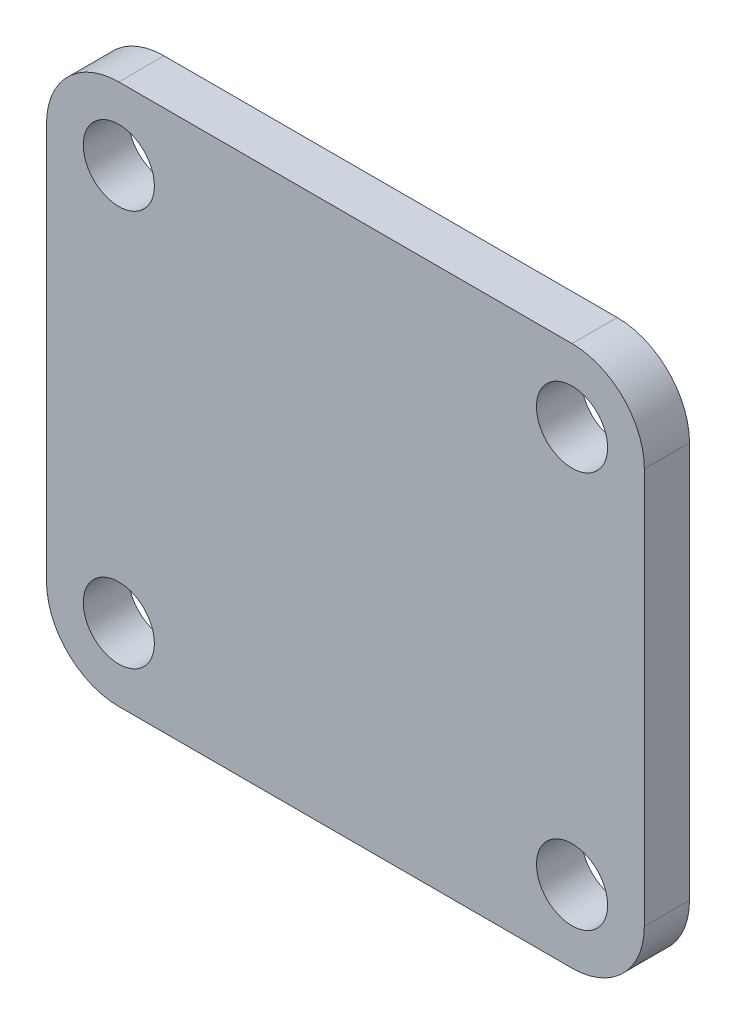
ISO-10303-21;
HEADER;
FILE_DESCRIPTION(('STEP AP214'),'2;1');
FILE_NAME('part.step','',(''),(''),'','','');
FILE_SCHEMA(('AUTOMOTIVE_DESIGN { 1 0 10303 214 1 1 1 1 }'));
ENDSEC;
DATA;
#1=APPLICATION_CONTEXT('core data for automotive mechanical design processes');
#2=APPLICATION_PROTOCOL_DEFINITION('international standard','automotive_design',2000,#1);
#3=PRODUCT_CONTEXT('',#1,'mechanical');
#4=PRODUCT('Part','Part','',(#3));
#5=PRODUCT_RELATED_PRODUCT_CATEGORY('part','',(#4));
#6=PRODUCT_DEFINITION_FORMATION('','',#4);
#7=PRODUCT_DEFINITION_CONTEXT('part definition',#1,'design');
#8=PRODUCT_DEFINITION('design','',#6,#7);
#9=PRODUCT_DEFINITION_SHAPE('','',#8);
#10=(LENGTH_UNIT() NAMED_UNIT(*) SI_UNIT(.MILLI.,.METRE.));
#11=(NAMED_UNIT(*) PLANE_ANGLE_UNIT() SI_UNIT($,.RADIAN.));
#12=(NAMED_UNIT(*) SI_UNIT($,.STERADIAN.) SOLID_ANGLE_UNIT());
#13=UNCERTAINTY_MEASURE_WITH_UNIT(LENGTH_MEASURE(1.E-05),#10,'distance_accuracy_value','');
#14=(GEOMETRIC_REPRESENTATION_CONTEXT(3) GLOBAL_UNCERTAINTY_ASSIGNED_CONTEXT((#13)) GLOBAL_UNIT_ASSIGNED_CONTEXT((#10,
#11,#12)) REPRESENTATION_CONTEXT('',''));
#15=CARTESIAN_POINT('',(0.,0.,0.));
#16=DIRECTION('',(0.,0.,1.));
#17=DIRECTION('',(1.,0.,0.));
#18=AXIS2_PLACEMENT_3D('',#15,#16,#17);
#19=CARTESIAN_POINT('',(-7.96,-6.96,1.5875));
#20=DIRECTION('',(0.,0.,-1.));
#21=DIRECTION('',(-1.,0.,0.));
#22=AXIS2_PLACEMENT_3D('',#19,#20,#21);
#23=CYLINDRICAL_SURFACE('',#22,2.54);
#24=CARTESIAN_POINT('',(-7.96,-6.96,0.));
#25=DIRECTION('',(0.,0.,1.));
#26=DIRECTION('',(-1.,0.,0.));
#27=AXIS2_PLACEMENT_3D('',#24,#25,#26);
#28=CIRCLE('',#27,2.54);
#29=CARTESIAN_POINT('',(-10.5,-6.96,0.));
#30=VERTEX_POINT('',#29);
#31=CARTESIAN_POINT('',(-7.96,-9.5,0.));
#32=VERTEX_POINT('',#31);
#33=EDGE_CURVE('E142',#30,#32,#28,.T.);
#34=ORIENTED_EDGE('',*,*,#33,.T.);
#35=DIRECTION('',(0.,0.,-1.));
#36=VECTOR('',#35,1.);
#37=CARTESIAN_POINT('',(-7.96,-9.5,1.5875));
#38=LINE('',#37,#36);
#39=CARTESIAN_POINT('',(-7.96,-9.5,1.5875));
#40=VERTEX_POINT('',#39);
#41=EDGE_CURVE('E11',#40,#32,#38,.T.);
#42=ORIENTED_EDGE('',*,*,#41,.F.);
#43=CARTESIAN_POINT('',(-7.96,-6.96,1.5875));
#44=DIRECTION('',(0.,0.,1.));
#45=DIRECTION('',(-1.,0.,0.));
#46=AXIS2_PLACEMENT_3D('',#43,#44,#45);
#47=CIRCLE('',#46,2.54);
#48=CARTESIAN_POINT('',(-10.5,-6.96,1.5875));
#49=VERTEX_POINT('',#48);
#50=EDGE_CURVE('E165',#49,#40,#47,.T.);
#51=ORIENTED_EDGE('',*,*,#50,.F.);
#52=DIRECTION('',(0.,0.,-1.));
#53=VECTOR('',#52,1.);
#54=CARTESIAN_POINT('',(-10.5,-6.96,1.5875));
#55=LINE('',#54,#53);
#56=EDGE_CURVE('E138',#49,#30,#55,.T.);
#57=ORIENTED_EDGE('',*,*,#56,.T.);
#58=EDGE_LOOP('',(#34,#42,#51,#57));
#59=FACE_BOUND('',#58,.T.);
#60=ADVANCED_FACE('F39',(#59),#23,.T.);
#61=CARTESIAN_POINT('',(7.96,-9.5,1.5875));
#62=DIRECTION('',(0.,1.,0.));
#63=DIRECTION('',(0.,0.,1.));
#64=AXIS2_PLACEMENT_3D('',#61,#62,#63);
#65=PLANE('',#64);
#66=DIRECTION('',(1.,0.,0.));
#67=VECTOR('',#66,1.);
#68=CARTESIAN_POINT('',(7.96,-9.5,0.));
#69=LINE('',#68,#67);
#70=CARTESIAN_POINT('',(7.96,-9.5,0.));
#71=VERTEX_POINT('',#70);
#72=EDGE_CURVE('E146',#32,#71,#69,.T.);
#73=ORIENTED_EDGE('',*,*,#72,.T.);
#74=DIRECTION('',(0.,0.,-1.));
#75=VECTOR('',#74,1.);
#76=CARTESIAN_POINT('',(7.96,-9.5,1.5875));
#77=LINE('',#76,#75);
#78=CARTESIAN_POINT('',(7.96,-9.5,1.5875));
#79=VERTEX_POINT('',#78);
#80=EDGE_CURVE('E48',#79,#71,#77,.T.);
#81=ORIENTED_EDGE('',*,*,#80,.F.);
#82=DIRECTION('',(1.,0.,0.));
#83=VECTOR('',#82,1.);
#84=CARTESIAN_POINT('',(7.96,-9.5,1.5875));
#85=LINE('',#84,#83);
#86=EDGE_CURVE('E99',#40,#79,#85,.T.);
#87=ORIENTED_EDGE('',*,*,#86,.F.);
#88=ORIENTED_EDGE('',*,*,#41,.T.);
#89=EDGE_LOOP('',(#73,#81,#87,#88));
#90=FACE_BOUND('',#89,.T.);
#91=ADVANCED_FACE('F268',(#90),#65,.F.);
#92=CARTESIAN_POINT('',(7.96,-6.96,1.5875));
#93=DIRECTION('',(0.,0.,-1.));
#94=DIRECTION('',(-1.,0.,0.));
#95=AXIS2_PLACEMENT_3D('',#92,#93,#94);
#96=CYLINDRICAL_SURFACE('',#95,2.54);
#97=CARTESIAN_POINT('',(7.96,-6.96,0.));
#98=DIRECTION('',(0.,0.,1.));
#99=DIRECTION('',(1.,0.,0.));
#100=AXIS2_PLACEMENT_3D('',#97,#98,#99);
#101=CIRCLE('',#100,2.54);
#102=CARTESIAN_POINT('',(10.5,-6.96,0.));
#103=VERTEX_POINT('',#102);
#104=EDGE_CURVE('E150',#71,#103,#101,.T.);
#105=ORIENTED_EDGE('',*,*,#104,.T.);
#106=DIRECTION('',(0.,0.,-1.));
#107=VECTOR('',#106,1.);
#108=CARTESIAN_POINT('',(10.5,-6.96,1.5875));
#109=LINE('',#108,#107);
#110=CARTESIAN_POINT('',(10.5,-6.96,1.5875));
#111=VERTEX_POINT('',#110);
#112=EDGE_CURVE('E176',#111,#103,#109,.T.);
#113=ORIENTED_EDGE('',*,*,#112,.F.);
#114=CARTESIAN_POINT('',(7.96,-6.96,1.5875));
#115=DIRECTION('',(0.,0.,1.));
#116=DIRECTION('',(1.,0.,0.));
#117=AXIS2_PLACEMENT_3D('',#114,#115,#116);
#118=CIRCLE('',#117,2.54);
#119=EDGE_CURVE('E187',#79,#111,#118,.T.);
#120=ORIENTED_EDGE('',*,*,#119,.F.);
#121=ORIENTED_EDGE('',*,*,#80,.T.);
#122=EDGE_LOOP('',(#105,#113,#120,#121));
#123=FACE_BOUND('',#122,.T.);
#124=ADVANCED_FACE('F185',(#123),#96,.T.);
#125=CARTESIAN_POINT('',(10.5,-6.96,1.5875));
#126=DIRECTION('',(-1.,0.,0.));
#127=DIRECTION('',(0.,0.,1.));
#128=AXIS2_PLACEMENT_3D('',#125,#126,#127);
#129=PLANE('',#128);
#130=DIRECTION('',(0.,1.,0.));
#131=VECTOR('',#130,1.);
#132=CARTESIAN_POINT('',(10.5,-6.96,0.));
#133=LINE('',#132,#131);
#134=CARTESIAN_POINT('',(10.5,6.96,0.));
#135=VERTEX_POINT('',#134);
#136=EDGE_CURVE('E153',#103,#135,#133,.T.);
#137=ORIENTED_EDGE('',*,*,#136,.T.);
#138=DIRECTION('',(0.,0.,-1.));
#139=VECTOR('',#138,1.);
#140=CARTESIAN_POINT('',(10.5,6.96,1.5875));
#141=LINE('',#140,#139);
#142=CARTESIAN_POINT('',(10.5,6.96,1.5875));
#143=VERTEX_POINT('',#142);
#144=EDGE_CURVE('E172',#143,#135,#141,.T.);
#145=ORIENTED_EDGE('',*,*,#144,.F.);
#146=DIRECTION('',(0.,1.,0.));
#147=VECTOR('',#146,1.);
#148=CARTESIAN_POINT('',(10.5,-6.96,1.5875));
#149=LINE('',#148,#147);
#150=EDGE_CURVE('E200',#111,#143,#149,.T.);
#151=ORIENTED_EDGE('',*,*,#150,.F.);
#152=ORIENTED_EDGE('',*,*,#112,.T.);
#153=EDGE_LOOP('',(#137,#145,#151,#152));
#154=FACE_BOUND('',#153,.T.);
#155=ADVANCED_FACE('F195',(#154),#129,.F.);
#156=CARTESIAN_POINT('',(7.96,6.96,1.5875));
#157=DIRECTION('',(0.,0.,-1.));
#158=DIRECTION('',(-1.,0.,0.));
#159=AXIS2_PLACEMENT_3D('',#156,#157,#158);
#160=CYLINDRICAL_SURFACE('',#159,2.54);
#161=CARTESIAN_POINT('',(7.96,6.96,0.));
#162=DIRECTION('',(0.,0.,1.));
#163=DIRECTION('',(1.,0.,0.));
#164=AXIS2_PLACEMENT_3D('',#161,#162,#163);
#165=CIRCLE('',#164,2.54);
#166=CARTESIAN_POINT('',(7.96,9.5,0.));
#167=VERTEX_POINT('',#166);
#168=EDGE_CURVE('E156',#135,#167,#165,.T.);
#169=ORIENTED_EDGE('',*,*,#168,.T.);
#170=DIRECTION('',(0.,0.,-1.));
#171=VECTOR('',#170,1.);
#172=CARTESIAN_POINT('',(7.96,9.5,1.5875));
#173=LINE('',#172,#171);
#174=CARTESIAN_POINT('',(7.96,9.5,1.5875));
#175=VERTEX_POINT('',#174);
#176=EDGE_CURVE('E129',#175,#167,#173,.T.);
#177=ORIENTED_EDGE('',*,*,#176,.F.);
#178=CARTESIAN_POINT('',(7.96,6.96,1.5875));
#179=DIRECTION('',(0.,0.,1.));
#180=DIRECTION('',(1.,0.,0.));
#181=AXIS2_PLACEMENT_3D('',#178,#179,#180);
#182=CIRCLE('',#181,2.54);
#183=EDGE_CURVE('E118',#143,#175,#182,.T.);
#184=ORIENTED_EDGE('',*,*,#183,.F.);
#185=ORIENTED_EDGE('',*,*,#144,.T.);
#186=EDGE_LOOP('',(#169,#177,#184,#185));
#187=FACE_BOUND('',#186,.T.);
#188=ADVANCED_FACE('F198',(#187),#160,.T.);
#189=CARTESIAN_POINT('',(7.96,9.5,1.5875));
#190=DIRECTION('',(0.,-1.,0.));
#191=DIRECTION('',(0.,0.,-1.));
#192=AXIS2_PLACEMENT_3D('',#189,#190,#191);
#193=PLANE('',#192);
#194=DIRECTION('',(-1.,0.,0.));
#195=VECTOR('',#194,1.);
#196=CARTESIAN_POINT('',(7.96,9.5,0.));
#197=LINE('',#196,#195);
#198=CARTESIAN_POINT('',(-7.96,9.5,0.));
#199=VERTEX_POINT('',#198);
#200=EDGE_CURVE('E127',#167,#199,#197,.T.);
#201=ORIENTED_EDGE('',*,*,#200,.T.);
#202=DIRECTION('',(0.,0.,-1.));
#203=VECTOR('',#202,1.);
#204=CARTESIAN_POINT('',(-7.96,9.5,1.5875));
#205=LINE('',#204,#203);
#206=CARTESIAN_POINT('',(-7.96,9.5,1.5875));
#207=VERTEX_POINT('',#206);
#208=EDGE_CURVE('E124',#207,#199,#205,.T.);
#209=ORIENTED_EDGE('',*,*,#208,.F.);
#210=DIRECTION('',(-1.,0.,0.));
#211=VECTOR('',#210,1.);
#212=CARTESIAN_POINT('',(7.96,9.5,1.5875));
#213=LINE('',#212,#211);
#214=EDGE_CURVE('E112',#175,#207,#213,.T.);
#215=ORIENTED_EDGE('',*,*,#214,.F.);
#216=ORIENTED_EDGE('',*,*,#176,.T.);
#217=EDGE_LOOP('',(#201,#209,#215,#216));
#218=FACE_BOUND('',#217,.T.);
#219=ADVANCED_FACE('F125',(#218),#193,.F.);
#220=CARTESIAN_POINT('',(-7.96,6.96,1.5875));
#221=DIRECTION('',(0.,0.,-1.));
#222=DIRECTION('',(-1.,0.,0.));
#223=AXIS2_PLACEMENT_3D('',#220,#221,#222);
#224=CYLINDRICAL_SURFACE('',#223,2.54);
#225=CARTESIAN_POINT('',(-7.96,6.96,0.));
#226=DIRECTION('',(0.,0.,1.));
#227=DIRECTION('',(1.,0.,0.));
#228=AXIS2_PLACEMENT_3D('',#225,#226,#227);
#229=CIRCLE('',#228,2.54);
#230=CARTESIAN_POINT('',(-10.5,6.96,0.));
#231=VERTEX_POINT('',#230);
#232=EDGE_CURVE('E85',#199,#231,#229,.T.);
#233=ORIENTED_EDGE('',*,*,#232,.T.);
#234=DIRECTION('',(0.,0.,-1.));
#235=VECTOR('',#234,1.);
#236=CARTESIAN_POINT('',(-10.5,6.96,1.5875));
#237=LINE('',#236,#235);
#238=CARTESIAN_POINT('',(-10.5,6.96,1.5875));
#239=VERTEX_POINT('',#238);
#240=EDGE_CURVE('E130',#239,#231,#237,.T.);
#241=ORIENTED_EDGE('',*,*,#240,.F.);
#242=CARTESIAN_POINT('',(-7.96,6.96,1.5875));
#243=DIRECTION('',(0.,0.,1.));
#244=DIRECTION('',(1.,0.,0.));
#245=AXIS2_PLACEMENT_3D('',#242,#243,#244);
#246=CIRCLE('',#245,2.54);
#247=EDGE_CURVE('E116',#207,#239,#246,.T.);
#248=ORIENTED_EDGE('',*,*,#247,.F.);
#249=ORIENTED_EDGE('',*,*,#208,.T.);
#250=EDGE_LOOP('',(#233,#241,#248,#249));
#251=FACE_BOUND('',#250,.T.);
#252=ADVANCED_FACE('F132',(#251),#224,.T.);
#253=CARTESIAN_POINT('',(-10.5,-6.96,1.5875));
#254=DIRECTION('',(1.,0.,0.));
#255=DIRECTION('',(0.,0.,-1.));
#256=AXIS2_PLACEMENT_3D('',#253,#254,#255);
#257=PLANE('',#256);
#258=DIRECTION('',(0.,-1.,0.));
#259=VECTOR('',#258,1.);
#260=CARTESIAN_POINT('',(-10.5,-6.96,0.));
#261=LINE('',#260,#259);
#262=EDGE_CURVE('E91',#231,#30,#261,.T.);
#263=ORIENTED_EDGE('',*,*,#262,.T.);
#264=ORIENTED_EDGE('',*,*,#56,.F.);
#265=DIRECTION('',(0.,-1.,0.));
#266=VECTOR('',#265,1.);
#267=CARTESIAN_POINT('',(-10.5,-6.96,1.5875));
#268=LINE('',#267,#266);
#269=EDGE_CURVE('E56',#239,#49,#268,.T.);
#270=ORIENTED_EDGE('',*,*,#269,.F.);
#271=ORIENTED_EDGE('',*,*,#240,.T.);
#272=EDGE_LOOP('',(#263,#264,#270,#271));
#273=FACE_BOUND('',#272,.T.);
#274=ADVANCED_FACE('F251',(#273),#257,.F.);
#275=CARTESIAN_POINT('',(-7.96,-6.96,1.5875));
#276=DIRECTION('',(0.,0.,-1.));
#277=DIRECTION('',(-1.,0.,0.));
#278=AXIS2_PLACEMENT_3D('',#275,#276,#277);
#279=PLANE('',#278);
#280=CARTESIAN_POINT('',(-7.96,-6.96,1.5875));
#281=DIRECTION('',(0.,0.,1.));
#282=DIRECTION('',(1.,0.,0.));
#283=AXIS2_PLACEMENT_3D('',#280,#281,#282);
#284=CIRCLE('',#283,1.25);
#285=CARTESIAN_POINT('',(-6.71,-6.96,1.5875));
#286=VERTEX_POINT('',#285);
#287=EDGE_CURVE('E218',#286,#286,#284,.T.);
#288=ORIENTED_EDGE('',*,*,#287,.F.);
#289=EDGE_LOOP('',(#288));
#290=FACE_BOUND('',#289,.T.);
#291=CARTESIAN_POINT('',(7.96,-6.96,1.5875));
#292=DIRECTION('',(0.,0.,1.));
#293=DIRECTION('',(1.,0.,0.));
#294=AXIS2_PLACEMENT_3D('',#291,#292,#293);
#295=CIRCLE('',#294,1.25);
#296=CARTESIAN_POINT('',(9.21,-6.96,1.5875));
#297=VERTEX_POINT('',#296);
#298=EDGE_CURVE('E225',#297,#297,#295,.T.);
#299=ORIENTED_EDGE('',*,*,#298,.F.);
#300=EDGE_LOOP('',(#299));
#301=FACE_BOUND('',#300,.T.);
#302=CARTESIAN_POINT('',(7.96,6.96,1.5875));
#303=DIRECTION('',(0.,0.,1.));
#304=DIRECTION('',(1.,0.,0.));
#305=AXIS2_PLACEMENT_3D('',#302,#303,#304);
#306=CIRCLE('',#305,1.25);
#307=CARTESIAN_POINT('',(9.21,6.96,1.5875));
#308=VERTEX_POINT('',#307);
#309=EDGE_CURVE('E233',#308,#308,#306,.T.);
#310=ORIENTED_EDGE('',*,*,#309,.F.);
#311=EDGE_LOOP('',(#310));
#312=FACE_BOUND('',#311,.T.);
#313=CARTESIAN_POINT('',(-7.96,6.96,1.5875));
#314=DIRECTION('',(0.,0.,1.));
#315=DIRECTION('',(1.,0.,0.));
#316=AXIS2_PLACEMENT_3D('',#313,#314,#315);
#317=CIRCLE('',#316,1.25);
#318=CARTESIAN_POINT('',(-6.71,6.96,1.5875));
#319=VERTEX_POINT('',#318);
#320=EDGE_CURVE('E210',#319,#319,#317,.T.);
#321=ORIENTED_EDGE('',*,*,#320,.F.);
#322=EDGE_LOOP('',(#321));
#323=FACE_BOUND('',#322,.T.);
#324=ORIENTED_EDGE('',*,*,#50,.T.);
#325=ORIENTED_EDGE('',*,*,#86,.T.);
#326=ORIENTED_EDGE('',*,*,#119,.T.);
#327=ORIENTED_EDGE('',*,*,#150,.T.);
#328=ORIENTED_EDGE('',*,*,#183,.T.);
#329=ORIENTED_EDGE('',*,*,#214,.T.);
#330=ORIENTED_EDGE('',*,*,#247,.T.);
#331=ORIENTED_EDGE('',*,*,#269,.T.);
#332=EDGE_LOOP('',(#324,#325,#326,#327,#328,#329,#330,#331));
#333=FACE_BOUND('',#332,.T.);
#334=ADVANCED_FACE('F114',(#290,#301,#312,#323,#333),#279,.F.);
#335=CARTESIAN_POINT('',(-7.96,-6.96,0.));
#336=DIRECTION('',(0.,0.,-1.));
#337=DIRECTION('',(-1.,0.,0.));
#338=AXIS2_PLACEMENT_3D('',#335,#336,#337);
#339=PLANE('',#338);
#340=CARTESIAN_POINT('',(-7.96,-6.96,0.));
#341=DIRECTION('',(0.,0.,1.));
#342=DIRECTION('',(1.,0.,0.));
#343=AXIS2_PLACEMENT_3D('',#340,#341,#342);
#344=CIRCLE('',#343,1.25);
#345=CARTESIAN_POINT('',(-6.71,-6.96,0.));
#346=VERTEX_POINT('',#345);
#347=EDGE_CURVE('E222',#346,#346,#344,.T.);
#348=ORIENTED_EDGE('',*,*,#347,.T.);
#349=EDGE_LOOP('',(#348));
#350=FACE_BOUND('',#349,.T.);
#351=CARTESIAN_POINT('',(7.96,-6.96,0.));
#352=DIRECTION('',(0.,0.,1.));
#353=DIRECTION('',(1.,0.,0.));
#354=AXIS2_PLACEMENT_3D('',#351,#352,#353);
#355=CIRCLE('',#354,1.25);
#356=CARTESIAN_POINT('',(9.21,-6.96,0.));
#357=VERTEX_POINT('',#356);
#358=EDGE_CURVE('E229',#357,#357,#355,.T.);
#359=ORIENTED_EDGE('',*,*,#358,.T.);
#360=EDGE_LOOP('',(#359));
#361=FACE_BOUND('',#360,.T.);
#362=CARTESIAN_POINT('',(7.96,6.96,0.));
#363=DIRECTION('',(0.,0.,1.));
#364=DIRECTION('',(1.,0.,0.));
#365=AXIS2_PLACEMENT_3D('',#362,#363,#364);
#366=CIRCLE('',#365,1.25);
#367=CARTESIAN_POINT('',(9.21,6.96,0.));
#368=VERTEX_POINT('',#367);
#369=EDGE_CURVE('E214',#368,#368,#366,.T.);
#370=ORIENTED_EDGE('',*,*,#369,.T.);
#371=EDGE_LOOP('',(#370));
#372=FACE_BOUND('',#371,.T.);
#373=CARTESIAN_POINT('',(-7.96,6.96,0.));
#374=DIRECTION('',(0.,0.,1.));
#375=DIRECTION('',(1.,0.,0.));
#376=AXIS2_PLACEMENT_3D('',#373,#374,#375);
#377=CIRCLE('',#376,1.25);
#378=CARTESIAN_POINT('',(-6.71,6.96,0.));
#379=VERTEX_POINT('',#378);
#380=EDGE_CURVE('E147',#379,#379,#377,.T.);
#381=ORIENTED_EDGE('',*,*,#380,.T.);
#382=EDGE_LOOP('',(#381));
#383=FACE_BOUND('',#382,.T.);
#384=ORIENTED_EDGE('',*,*,#33,.F.);
#385=ORIENTED_EDGE('',*,*,#262,.F.);
#386=ORIENTED_EDGE('',*,*,#232,.F.);
#387=ORIENTED_EDGE('',*,*,#200,.F.);
#388=ORIENTED_EDGE('',*,*,#168,.F.);
#389=ORIENTED_EDGE('',*,*,#136,.F.);
#390=ORIENTED_EDGE('',*,*,#104,.F.);
#391=ORIENTED_EDGE('',*,*,#72,.F.);
#392=EDGE_LOOP('',(#384,#385,#386,#387,#388,#389,#390,#391));
#393=FACE_BOUND('',#392,.T.);
#394=ADVANCED_FACE('F191',(#350,#361,#372,#383,#393),#339,.T.);
#395=CARTESIAN_POINT('',(-7.96,6.96,0.));
#396=DIRECTION('',(0.,0.,1.));
#397=DIRECTION('',(1.,0.,0.));
#398=AXIS2_PLACEMENT_3D('',#395,#396,#397);
#399=CYLINDRICAL_SURFACE('',#398,1.25);
#400=ORIENTED_EDGE('',*,*,#380,.F.);
#401=EDGE_LOOP('',(#400));
#402=FACE_BOUND('',#401,.T.);
#403=ORIENTED_EDGE('',*,*,#320,.T.);
#404=EDGE_LOOP('',(#403));
#405=FACE_BOUND('',#404,.T.);
#406=ADVANCED_FACE('F245',(#402,#405),#399,.F.);
#407=CARTESIAN_POINT('',(7.96,6.96,0.));
#408=DIRECTION('',(0.,0.,1.));
#409=DIRECTION('',(1.,0.,0.));
#410=AXIS2_PLACEMENT_3D('',#407,#408,#409);
#411=CYLINDRICAL_SURFACE('',#410,1.25);
#412=ORIENTED_EDGE('',*,*,#369,.F.);
#413=EDGE_LOOP('',(#412));
#414=FACE_BOUND('',#413,.T.);
#415=ORIENTED_EDGE('',*,*,#309,.T.);
#416=EDGE_LOOP('',(#415));
#417=FACE_BOUND('',#416,.T.);
#418=ADVANCED_FACE('F241',(#414,#417),#411,.F.);
#419=CARTESIAN_POINT('',(7.96,-6.96,0.));
#420=DIRECTION('',(0.,0.,1.));
#421=DIRECTION('',(1.,0.,0.));
#422=AXIS2_PLACEMENT_3D('',#419,#420,#421);
#423=CYLINDRICAL_SURFACE('',#422,1.25);
#424=ORIENTED_EDGE('',*,*,#358,.F.);
#425=EDGE_LOOP('',(#424));
#426=FACE_BOUND('',#425,.T.);
#427=ORIENTED_EDGE('',*,*,#298,.T.);
#428=EDGE_LOOP('',(#427));
#429=FACE_BOUND('',#428,.T.);
#430=ADVANCED_FACE('F244',(#426,#429),#423,.F.);
#431=CARTESIAN_POINT('',(-7.96,-6.96,0.));
#432=DIRECTION('',(0.,0.,1.));
#433=DIRECTION('',(1.,0.,0.));
#434=AXIS2_PLACEMENT_3D('',#431,#432,#433);
#435=CYLINDRICAL_SURFACE('',#434,1.25);
#436=ORIENTED_EDGE('',*,*,#347,.F.);
#437=EDGE_LOOP('',(#436));
#438=FACE_BOUND('',#437,.T.);
#439=ORIENTED_EDGE('',*,*,#287,.T.);
#440=EDGE_LOOP('',(#439));
#441=FACE_BOUND('',#440,.T.);
#442=ADVANCED_FACE('F342',(#438,#441),#435,.F.);
#443=CLOSED_SHELL('',(#60,#91,#124,#155,#188,#219,#252,#274,#334,#394,#406,#418,#430,#442));
#444=MANIFOLD_SOLID_BREP('B2',#443);
#445=ADVANCED_BREP_SHAPE_REPRESENTATION('',(#18,#444),#14);
#446=SHAPE_DEFINITION_REPRESENTATION(#9,#445);
ENDSEC;
END-ISO-10303-21;
